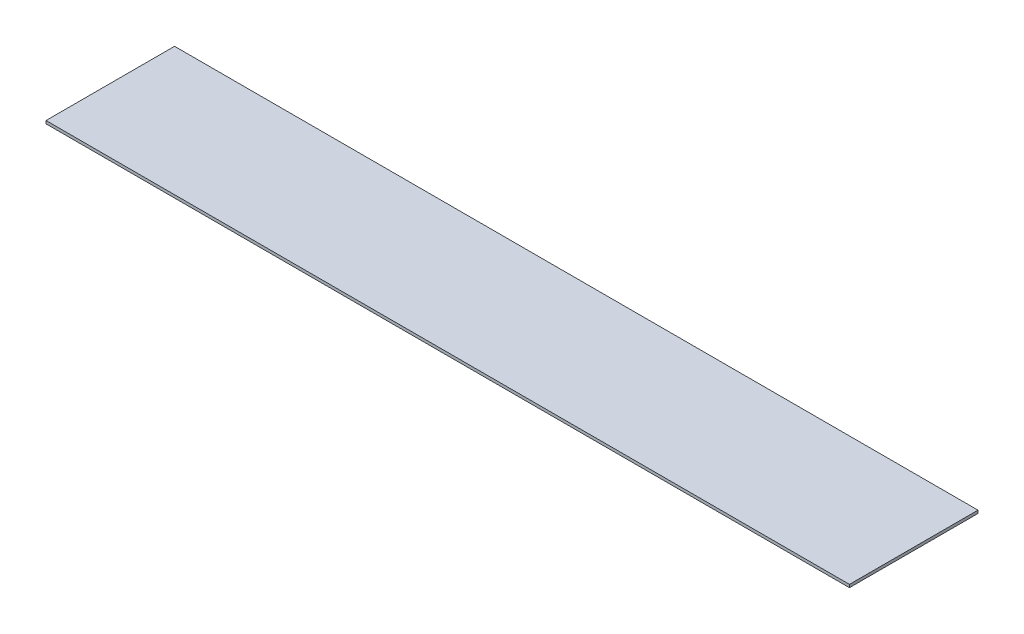
ISO-10303-21;
HEADER;
FILE_DESCRIPTION(('STEP AP214'),'2;1');
FILE_NAME('part.step','',(''),(''),'','','');
FILE_SCHEMA(('AUTOMOTIVE_DESIGN { 1 0 10303 214 1 1 1 1 }'));
ENDSEC;
DATA;
#1=APPLICATION_CONTEXT('core data for automotive mechanical design processes');
#2=APPLICATION_PROTOCOL_DEFINITION('international standard','automotive_design',2000,#1);
#3=PRODUCT_CONTEXT('',#1,'mechanical');
#4=PRODUCT('Part','Part','',(#3));
#5=PRODUCT_RELATED_PRODUCT_CATEGORY('part','',(#4));
#6=PRODUCT_DEFINITION_FORMATION('','',#4);
#7=PRODUCT_DEFINITION_CONTEXT('part definition',#1,'design');
#8=PRODUCT_DEFINITION('design','',#6,#7);
#9=PRODUCT_DEFINITION_SHAPE('','',#8);
#10=(LENGTH_UNIT() NAMED_UNIT(*) SI_UNIT(.MILLI.,.METRE.));
#11=(NAMED_UNIT(*) PLANE_ANGLE_UNIT() SI_UNIT($,.RADIAN.));
#12=(NAMED_UNIT(*) SI_UNIT($,.STERADIAN.) SOLID_ANGLE_UNIT());
#13=UNCERTAINTY_MEASURE_WITH_UNIT(LENGTH_MEASURE(1.E-05),#10,'distance_accuracy_value','');
#14=(GEOMETRIC_REPRESENTATION_CONTEXT(3) GLOBAL_UNCERTAINTY_ASSIGNED_CONTEXT((#13)) GLOBAL_UNIT_ASSIGNED_CONTEXT((#10,
#11,#12)) REPRESENTATION_CONTEXT('',''));
#15=CARTESIAN_POINT('',(0.,0.,0.));
#16=DIRECTION('',(0.,0.,1.));
#17=DIRECTION('',(1.,0.,0.));
#18=AXIS2_PLACEMENT_3D('',#15,#16,#17);
#19=CARTESIAN_POINT('',(25.,0.18,-4.));
#20=DIRECTION('',(-1.,0.,0.));
#21=DIRECTION('',(0.,0.,1.));
#22=AXIS2_PLACEMENT_3D('',#19,#20,#21);
#23=PLANE('',#22);
#24=DIRECTION('',(0.,0.,-1.));
#25=VECTOR('',#24,1.);
#26=CARTESIAN_POINT('',(25.,0.,-4.));
#27=LINE('',#26,#25);
#28=CARTESIAN_POINT('',(25.,0.,4.));
#29=VERTEX_POINT('',#28);
#30=CARTESIAN_POINT('',(25.,0.,-4.));
#31=VERTEX_POINT('',#30);
#32=EDGE_CURVE('E96',#29,#31,#27,.T.);
#33=ORIENTED_EDGE('',*,*,#32,.T.);
#34=DIRECTION('',(0.,-1.,0.));
#35=VECTOR('',#34,1.);
#36=CARTESIAN_POINT('',(25.,0.18,-4.));
#37=LINE('',#36,#35);
#38=CARTESIAN_POINT('',(25.,0.18,-4.));
#39=VERTEX_POINT('',#38);
#40=EDGE_CURVE('E11',#39,#31,#37,.T.);
#41=ORIENTED_EDGE('',*,*,#40,.F.);
#42=DIRECTION('',(0.,0.,-1.));
#43=VECTOR('',#42,1.);
#44=CARTESIAN_POINT('',(25.,0.18,-4.));
#45=LINE('',#44,#43);
#46=CARTESIAN_POINT('',(25.,0.18,4.));
#47=VERTEX_POINT('',#46);
#48=EDGE_CURVE('E84',#47,#39,#45,.T.);
#49=ORIENTED_EDGE('',*,*,#48,.F.);
#50=DIRECTION('',(0.,-1.,0.));
#51=VECTOR('',#50,1.);
#52=CARTESIAN_POINT('',(25.,0.18,4.));
#53=LINE('',#52,#51);
#54=EDGE_CURVE('E92',#47,#29,#53,.T.);
#55=ORIENTED_EDGE('',*,*,#54,.T.);
#56=EDGE_LOOP('',(#33,#41,#49,#55));
#57=FACE_BOUND('',#56,.T.);
#58=ADVANCED_FACE('F33',(#57),#23,.F.);
#59=CARTESIAN_POINT('',(-25.,0.18,-4.));
#60=DIRECTION('',(0.,0.,1.));
#61=DIRECTION('',(1.,0.,0.));
#62=AXIS2_PLACEMENT_3D('',#59,#60,#61);
#63=PLANE('',#62);
#64=DIRECTION('',(-1.,0.,0.));
#65=VECTOR('',#64,1.);
#66=CARTESIAN_POINT('',(-25.,0.,-4.));
#67=LINE('',#66,#65);
#68=CARTESIAN_POINT('',(-25.,0.,-4.));
#69=VERTEX_POINT('',#68);
#70=EDGE_CURVE('E88',#31,#69,#67,.T.);
#71=ORIENTED_EDGE('',*,*,#70,.T.);
#72=DIRECTION('',(0.,-1.,0.));
#73=VECTOR('',#72,1.);
#74=CARTESIAN_POINT('',(-25.,0.18,-4.));
#75=LINE('',#74,#73);
#76=CARTESIAN_POINT('',(-25.,0.18,-4.));
#77=VERTEX_POINT('',#76);
#78=EDGE_CURVE('E41',#77,#69,#75,.T.);
#79=ORIENTED_EDGE('',*,*,#78,.F.);
#80=DIRECTION('',(-1.,0.,0.));
#81=VECTOR('',#80,1.);
#82=CARTESIAN_POINT('',(-25.,0.18,-4.));
#83=LINE('',#82,#81);
#84=EDGE_CURVE('E79',#39,#77,#83,.T.);
#85=ORIENTED_EDGE('',*,*,#84,.F.);
#86=ORIENTED_EDGE('',*,*,#40,.T.);
#87=EDGE_LOOP('',(#71,#79,#85,#86));
#88=FACE_BOUND('',#87,.T.);
#89=ADVANCED_FACE('F87',(#88),#63,.F.);
#90=CARTESIAN_POINT('',(-25.,0.18,-4.));
#91=DIRECTION('',(1.,0.,0.));
#92=DIRECTION('',(0.,0.,-1.));
#93=AXIS2_PLACEMENT_3D('',#90,#91,#92);
#94=PLANE('',#93);
#95=DIRECTION('',(0.,0.,1.));
#96=VECTOR('',#95,1.);
#97=CARTESIAN_POINT('',(-25.,0.,-4.));
#98=LINE('',#97,#96);
#99=CARTESIAN_POINT('',(-25.,0.,4.));
#100=VERTEX_POINT('',#99);
#101=EDGE_CURVE('E66',#69,#100,#98,.T.);
#102=ORIENTED_EDGE('',*,*,#101,.T.);
#103=DIRECTION('',(0.,-1.,0.));
#104=VECTOR('',#103,1.);
#105=CARTESIAN_POINT('',(-25.,0.18,4.));
#106=LINE('',#105,#104);
#107=CARTESIAN_POINT('',(-25.,0.18,4.));
#108=VERTEX_POINT('',#107);
#109=EDGE_CURVE('E89',#108,#100,#106,.T.);
#110=ORIENTED_EDGE('',*,*,#109,.F.);
#111=DIRECTION('',(0.,0.,1.));
#112=VECTOR('',#111,1.);
#113=CARTESIAN_POINT('',(-25.,0.18,-4.));
#114=LINE('',#113,#112);
#115=EDGE_CURVE('E82',#77,#108,#114,.T.);
#116=ORIENTED_EDGE('',*,*,#115,.F.);
#117=ORIENTED_EDGE('',*,*,#78,.T.);
#118=EDGE_LOOP('',(#102,#110,#116,#117));
#119=FACE_BOUND('',#118,.T.);
#120=ADVANCED_FACE('F90',(#119),#94,.F.);
#121=CARTESIAN_POINT('',(-25.,0.18,4.));
#122=DIRECTION('',(0.,0.,-1.));
#123=DIRECTION('',(-1.,0.,0.));
#124=AXIS2_PLACEMENT_3D('',#121,#122,#123);
#125=PLANE('',#124);
#126=DIRECTION('',(1.,0.,0.));
#127=VECTOR('',#126,1.);
#128=CARTESIAN_POINT('',(-25.,0.,4.));
#129=LINE('',#128,#127);
#130=EDGE_CURVE('E72',#100,#29,#129,.T.);
#131=ORIENTED_EDGE('',*,*,#130,.T.);
#132=ORIENTED_EDGE('',*,*,#54,.F.);
#133=DIRECTION('',(1.,0.,0.));
#134=VECTOR('',#133,1.);
#135=CARTESIAN_POINT('',(-25.,0.18,4.));
#136=LINE('',#135,#134);
#137=EDGE_CURVE('E49',#108,#47,#136,.T.);
#138=ORIENTED_EDGE('',*,*,#137,.F.);
#139=ORIENTED_EDGE('',*,*,#109,.T.);
#140=EDGE_LOOP('',(#131,#132,#138,#139));
#141=FACE_BOUND('',#140,.T.);
#142=ADVANCED_FACE('F103',(#141),#125,.F.);
#143=CARTESIAN_POINT('',(0.,0.18,0.));
#144=DIRECTION('',(0.,1.,0.));
#145=DIRECTION('',(0.,0.,1.));
#146=AXIS2_PLACEMENT_3D('',#143,#144,#145);
#147=PLANE('',#146);
#148=ORIENTED_EDGE('',*,*,#48,.T.);
#149=ORIENTED_EDGE('',*,*,#84,.T.);
#150=ORIENTED_EDGE('',*,*,#115,.T.);
#151=ORIENTED_EDGE('',*,*,#137,.T.);
#152=EDGE_LOOP('',(#148,#149,#150,#151));
#153=FACE_BOUND('',#152,.T.);
#154=ADVANCED_FACE('F80',(#153),#147,.T.);
#155=CARTESIAN_POINT('',(0.,0.,0.));
#156=DIRECTION('',(0.,1.,0.));
#157=DIRECTION('',(0.,0.,1.));
#158=AXIS2_PLACEMENT_3D('',#155,#156,#157);
#159=PLANE('',#158);
#160=ORIENTED_EDGE('',*,*,#32,.F.);
#161=ORIENTED_EDGE('',*,*,#130,.F.);
#162=ORIENTED_EDGE('',*,*,#101,.F.);
#163=ORIENTED_EDGE('',*,*,#70,.F.);
#164=EDGE_LOOP('',(#160,#161,#162,#163));
#165=FACE_BOUND('',#164,.T.);
#166=ADVANCED_FACE('F106',(#165),#159,.F.);
#167=CLOSED_SHELL('',(#58,#89,#120,#142,#154,#166));
#168=MANIFOLD_SOLID_BREP('B2',#167);
#169=ADVANCED_BREP_SHAPE_REPRESENTATION('',(#18,#168),#14);
#170=SHAPE_DEFINITION_REPRESENTATION(#9,#169);
ENDSEC;
END-ISO-10303-21;
